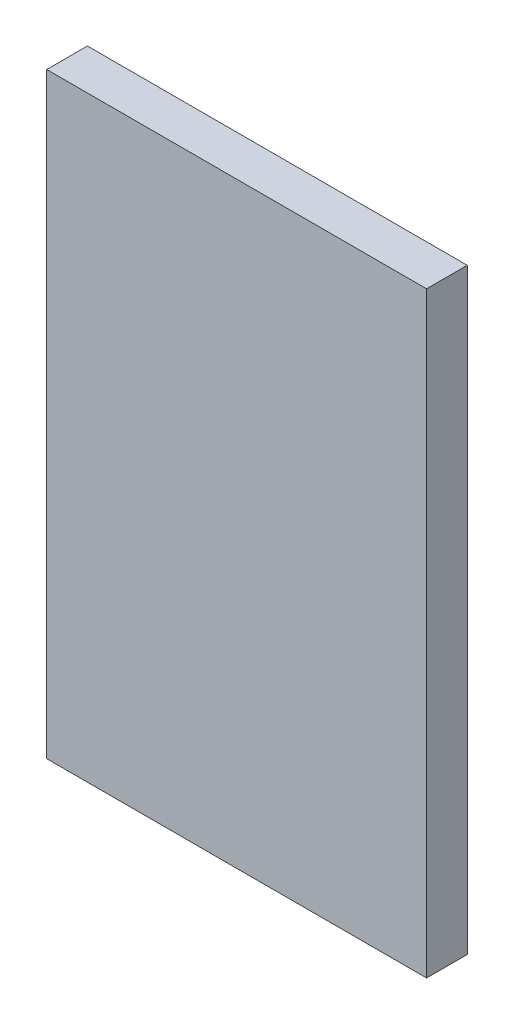
ISO-10303-21;
HEADER;
FILE_DESCRIPTION(('STEP AP214'),'2;1');
FILE_NAME('part.step','',(''),(''),'','','');
FILE_SCHEMA(('AUTOMOTIVE_DESIGN { 1 0 10303 214 1 1 1 1 }'));
ENDSEC;
DATA;
#1=APPLICATION_CONTEXT('core data for automotive mechanical design processes');
#2=APPLICATION_PROTOCOL_DEFINITION('international standard','automotive_design',2000,#1);
#3=PRODUCT_CONTEXT('',#1,'mechanical');
#4=PRODUCT('Part','Part','',(#3));
#5=PRODUCT_RELATED_PRODUCT_CATEGORY('part','',(#4));
#6=PRODUCT_DEFINITION_FORMATION('','',#4);
#7=PRODUCT_DEFINITION_CONTEXT('part definition',#1,'design');
#8=PRODUCT_DEFINITION('design','',#6,#7);
#9=PRODUCT_DEFINITION_SHAPE('','',#8);
#10=(LENGTH_UNIT() NAMED_UNIT(*) SI_UNIT(.MILLI.,.METRE.));
#11=(NAMED_UNIT(*) PLANE_ANGLE_UNIT() SI_UNIT($,.RADIAN.));
#12=(NAMED_UNIT(*) SI_UNIT($,.STERADIAN.) SOLID_ANGLE_UNIT());
#13=UNCERTAINTY_MEASURE_WITH_UNIT(LENGTH_MEASURE(1.E-05),#10,'distance_accuracy_value','');
#14=(GEOMETRIC_REPRESENTATION_CONTEXT(3) GLOBAL_UNCERTAINTY_ASSIGNED_CONTEXT((#13)) GLOBAL_UNIT_ASSIGNED_CONTEXT((#10,
#11,#12)) REPRESENTATION_CONTEXT('',''));
#15=CARTESIAN_POINT('',(0.,0.,0.));
#16=DIRECTION('',(0.,0.,1.));
#17=DIRECTION('',(1.,0.,0.));
#18=AXIS2_PLACEMENT_3D('',#15,#16,#17);
#19=CARTESIAN_POINT('',(88.9000000000001,-139.7,19.05));
#20=DIRECTION('',(-1.,0.,0.));
#21=DIRECTION('',(0.,0.,1.));
#22=AXIS2_PLACEMENT_3D('',#19,#20,#21);
#23=PLANE('',#22);
#24=DIRECTION('',(0.,1.,0.));
#25=VECTOR('',#24,1.);
#26=CARTESIAN_POINT('',(88.9000000000001,-139.7,0.));
#27=LINE('',#26,#25);
#28=CARTESIAN_POINT('',(88.9000000000001,-139.7,0.));
#29=VERTEX_POINT('',#28);
#30=CARTESIAN_POINT('',(88.9000000000001,139.7,0.));
#31=VERTEX_POINT('',#30);
#32=EDGE_CURVE('E102',#29,#31,#27,.T.);
#33=ORIENTED_EDGE('',*,*,#32,.T.);
#34=DIRECTION('',(0.,0.,-1.));
#35=VECTOR('',#34,1.);
#36=CARTESIAN_POINT('',(88.9000000000001,139.7,19.05));
#37=LINE('',#36,#35);
#38=CARTESIAN_POINT('',(88.9000000000001,139.7,19.05));
#39=VERTEX_POINT('',#38);
#40=EDGE_CURVE('E11',#39,#31,#37,.T.);
#41=ORIENTED_EDGE('',*,*,#40,.F.);
#42=DIRECTION('',(0.,1.,0.));
#43=VECTOR('',#42,1.);
#44=CARTESIAN_POINT('',(88.9000000000001,-139.7,19.05));
#45=LINE('',#44,#43);
#46=CARTESIAN_POINT('',(88.9000000000001,-139.7,19.05));
#47=VERTEX_POINT('',#46);
#48=EDGE_CURVE('E90',#47,#39,#45,.T.);
#49=ORIENTED_EDGE('',*,*,#48,.F.);
#50=DIRECTION('',(0.,0.,-1.));
#51=VECTOR('',#50,1.);
#52=CARTESIAN_POINT('',(88.9000000000001,-139.7,19.05));
#53=LINE('',#52,#51);
#54=EDGE_CURVE('E98',#47,#29,#53,.T.);
#55=ORIENTED_EDGE('',*,*,#54,.T.);
#56=EDGE_LOOP('',(#33,#41,#49,#55));
#57=FACE_BOUND('',#56,.T.);
#58=ADVANCED_FACE('F39',(#57),#23,.F.);
#59=CARTESIAN_POINT('',(-88.8999999999999,139.7,19.05));
#60=DIRECTION('',(0.,-1.,0.));
#61=DIRECTION('',(0.,0.,-1.));
#62=AXIS2_PLACEMENT_3D('',#59,#60,#61);
#63=PLANE('',#62);
#64=DIRECTION('',(-1.,0.,0.));
#65=VECTOR('',#64,1.);
#66=CARTESIAN_POINT('',(-88.8999999999999,139.7,0.));
#67=LINE('',#66,#65);
#68=CARTESIAN_POINT('',(-88.8999999999999,139.7,0.));
#69=VERTEX_POINT('',#68);
#70=EDGE_CURVE('E94',#31,#69,#67,.T.);
#71=ORIENTED_EDGE('',*,*,#70,.T.);
#72=DIRECTION('',(0.,0.,-1.));
#73=VECTOR('',#72,1.);
#74=CARTESIAN_POINT('',(-88.8999999999999,139.7,19.05));
#75=LINE('',#74,#73);
#76=CARTESIAN_POINT('',(-88.8999999999999,139.7,19.05));
#77=VERTEX_POINT('',#76);
#78=EDGE_CURVE('E47',#77,#69,#75,.T.);
#79=ORIENTED_EDGE('',*,*,#78,.F.);
#80=DIRECTION('',(-1.,0.,0.));
#81=VECTOR('',#80,1.);
#82=CARTESIAN_POINT('',(-88.8999999999999,139.7,19.05));
#83=LINE('',#82,#81);
#84=EDGE_CURVE('E85',#39,#77,#83,.T.);
#85=ORIENTED_EDGE('',*,*,#84,.F.);
#86=ORIENTED_EDGE('',*,*,#40,.T.);
#87=EDGE_LOOP('',(#71,#79,#85,#86));
#88=FACE_BOUND('',#87,.T.);
#89=ADVANCED_FACE('F93',(#88),#63,.F.);
#90=CARTESIAN_POINT('',(-88.8999999999999,-139.7,19.05));
#91=DIRECTION('',(1.,0.,0.));
#92=DIRECTION('',(0.,0.,-1.));
#93=AXIS2_PLACEMENT_3D('',#90,#91,#92);
#94=PLANE('',#93);
#95=DIRECTION('',(0.,-1.,0.));
#96=VECTOR('',#95,1.);
#97=CARTESIAN_POINT('',(-88.8999999999999,-139.7,0.));
#98=LINE('',#97,#96);
#99=CARTESIAN_POINT('',(-88.8999999999999,-139.7,0.));
#100=VERTEX_POINT('',#99);
#101=EDGE_CURVE('E72',#69,#100,#98,.T.);
#102=ORIENTED_EDGE('',*,*,#101,.T.);
#103=DIRECTION('',(0.,0.,-1.));
#104=VECTOR('',#103,1.);
#105=CARTESIAN_POINT('',(-88.8999999999999,-139.7,19.05));
#106=LINE('',#105,#104);
#107=CARTESIAN_POINT('',(-88.8999999999999,-139.7,19.05));
#108=VERTEX_POINT('',#107);
#109=EDGE_CURVE('E95',#108,#100,#106,.T.);
#110=ORIENTED_EDGE('',*,*,#109,.F.);
#111=DIRECTION('',(0.,-1.,0.));
#112=VECTOR('',#111,1.);
#113=CARTESIAN_POINT('',(-88.8999999999999,-139.7,19.05));
#114=LINE('',#113,#112);
#115=EDGE_CURVE('E88',#77,#108,#114,.T.);
#116=ORIENTED_EDGE('',*,*,#115,.F.);
#117=ORIENTED_EDGE('',*,*,#78,.T.);
#118=EDGE_LOOP('',(#102,#110,#116,#117));
#119=FACE_BOUND('',#118,.T.);
#120=ADVANCED_FACE('F96',(#119),#94,.F.);
#121=CARTESIAN_POINT('',(-88.8999999999999,-139.7,19.05));
#122=DIRECTION('',(0.,1.,0.));
#123=DIRECTION('',(0.,0.,1.));
#124=AXIS2_PLACEMENT_3D('',#121,#122,#123);
#125=PLANE('',#124);
#126=DIRECTION('',(1.,0.,0.));
#127=VECTOR('',#126,1.);
#128=CARTESIAN_POINT('',(-88.8999999999999,-139.7,0.));
#129=LINE('',#128,#127);
#130=EDGE_CURVE('E78',#100,#29,#129,.T.);
#131=ORIENTED_EDGE('',*,*,#130,.T.);
#132=ORIENTED_EDGE('',*,*,#54,.F.);
#133=DIRECTION('',(1.,0.,0.));
#134=VECTOR('',#133,1.);
#135=CARTESIAN_POINT('',(-88.8999999999999,-139.7,19.05));
#136=LINE('',#135,#134);
#137=EDGE_CURVE('E55',#108,#47,#136,.T.);
#138=ORIENTED_EDGE('',*,*,#137,.F.);
#139=ORIENTED_EDGE('',*,*,#109,.T.);
#140=EDGE_LOOP('',(#131,#132,#138,#139));
#141=FACE_BOUND('',#140,.T.);
#142=ADVANCED_FACE('F109',(#141),#125,.F.);
#143=CARTESIAN_POINT('',(0.,0.,19.05));
#144=DIRECTION('',(0.,0.,-1.));
#145=DIRECTION('',(-1.,0.,0.));
#146=AXIS2_PLACEMENT_3D('',#143,#144,#145);
#147=PLANE('',#146);
#148=ORIENTED_EDGE('',*,*,#48,.T.);
#149=ORIENTED_EDGE('',*,*,#84,.T.);
#150=ORIENTED_EDGE('',*,*,#115,.T.);
#151=ORIENTED_EDGE('',*,*,#137,.T.);
#152=EDGE_LOOP('',(#148,#149,#150,#151));
#153=FACE_BOUND('',#152,.T.);
#154=ADVANCED_FACE('F86',(#153),#147,.F.);
#155=CARTESIAN_POINT('',(0.,0.,0.));
#156=DIRECTION('',(0.,0.,-1.));
#157=DIRECTION('',(-1.,0.,0.));
#158=AXIS2_PLACEMENT_3D('',#155,#156,#157);
#159=PLANE('',#158);
#160=ORIENTED_EDGE('',*,*,#32,.F.);
#161=ORIENTED_EDGE('',*,*,#130,.F.);
#162=ORIENTED_EDGE('',*,*,#101,.F.);
#163=ORIENTED_EDGE('',*,*,#70,.F.);
#164=EDGE_LOOP('',(#160,#161,#162,#163));
#165=FACE_BOUND('',#164,.T.);
#166=ADVANCED_FACE('F112',(#165),#159,.T.);
#167=CLOSED_SHELL('',(#58,#89,#120,#142,#154,#166));
#168=MANIFOLD_SOLID_BREP('B2',#167);
#169=ADVANCED_BREP_SHAPE_REPRESENTATION('',(#18,#168),#14);
#170=SHAPE_DEFINITION_REPRESENTATION(#9,#169);
ENDSEC;
END-ISO-10303-21;
